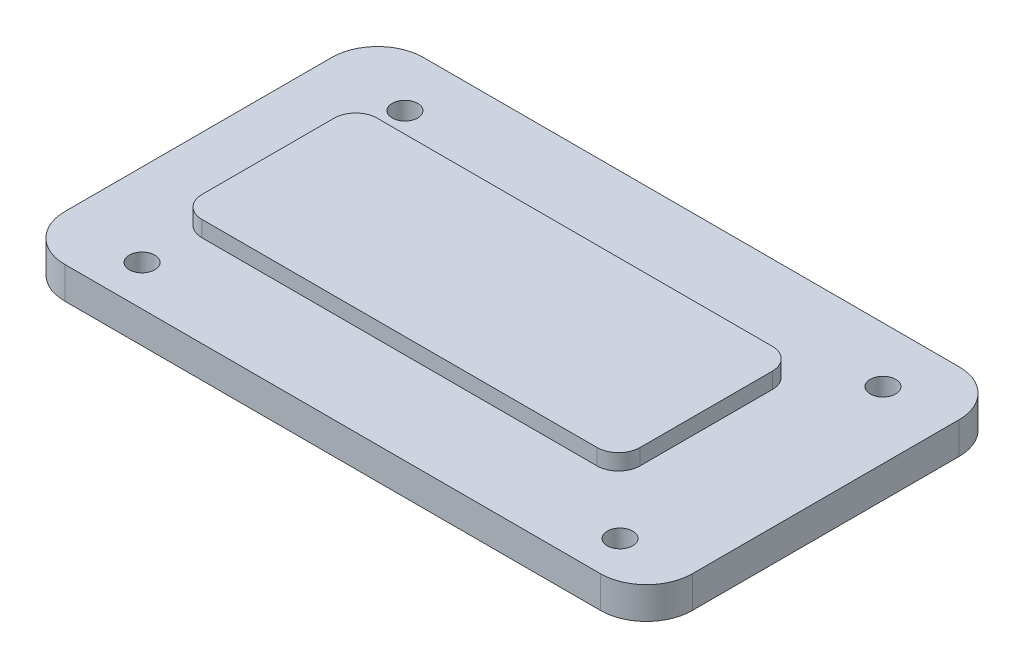
ISO-10303-21;
HEADER;
FILE_DESCRIPTION(('STEP AP214'),'2;1');
FILE_NAME('part.step','',(''),(''),'','','');
FILE_SCHEMA(('AUTOMOTIVE_DESIGN { 1 0 10303 214 1 1 1 1 }'));
ENDSEC;
DATA;
#1=APPLICATION_CONTEXT('core data for automotive mechanical design processes');
#2=APPLICATION_PROTOCOL_DEFINITION('international standard','automotive_design',2000,#1);
#3=PRODUCT_CONTEXT('',#1,'mechanical');
#4=PRODUCT('Part','Part','',(#3));
#5=PRODUCT_RELATED_PRODUCT_CATEGORY('part','',(#4));
#6=PRODUCT_DEFINITION_FORMATION('','',#4);
#7=PRODUCT_DEFINITION_CONTEXT('part definition',#1,'design');
#8=PRODUCT_DEFINITION('design','',#6,#7);
#9=PRODUCT_DEFINITION_SHAPE('','',#8);
#10=(LENGTH_UNIT() NAMED_UNIT(*) SI_UNIT(.MILLI.,.METRE.));
#11=(NAMED_UNIT(*) PLANE_ANGLE_UNIT() SI_UNIT($,.RADIAN.));
#12=(NAMED_UNIT(*) SI_UNIT($,.STERADIAN.) SOLID_ANGLE_UNIT());
#13=UNCERTAINTY_MEASURE_WITH_UNIT(LENGTH_MEASURE(1.E-05),#10,'distance_accuracy_value','');
#14=(GEOMETRIC_REPRESENTATION_CONTEXT(3) GLOBAL_UNCERTAINTY_ASSIGNED_CONTEXT((#13)) GLOBAL_UNIT_ASSIGNED_CONTEXT((#10,
#11,#12)) REPRESENTATION_CONTEXT('',''));
#15=CARTESIAN_POINT('',(0.,0.,0.));
#16=DIRECTION('',(0.,0.,1.));
#17=DIRECTION('',(1.,0.,0.));
#18=AXIS2_PLACEMENT_3D('',#15,#16,#17);
#19=CARTESIAN_POINT('',(18.375,3.,8.375));
#20=DIRECTION('',(0.,-1.,0.));
#21=DIRECTION('',(0.,0.,-1.));
#22=AXIS2_PLACEMENT_3D('',#19,#20,#21);
#23=CYLINDRICAL_SURFACE('',#22,2.875);
#24=CARTESIAN_POINT('',(18.375,2.,8.375));
#25=DIRECTION('',(0.,1.,0.));
#26=DIRECTION('',(0.,0.,1.));
#27=AXIS2_PLACEMENT_3D('',#24,#25,#26);
#28=CIRCLE('',#27,2.875);
#29=CARTESIAN_POINT('',(18.375,2.,11.25));
#30=VERTEX_POINT('',#29);
#31=CARTESIAN_POINT('',(21.25,2.,8.375));
#32=VERTEX_POINT('',#31);
#33=EDGE_CURVE('E216',#30,#32,#28,.T.);
#34=ORIENTED_EDGE('',*,*,#33,.F.);
#35=DIRECTION('',(0.,-1.,0.));
#36=VECTOR('',#35,1.);
#37=CARTESIAN_POINT('',(18.375,3.,11.25));
#38=LINE('',#37,#36);
#39=CARTESIAN_POINT('',(18.375,0.,11.25));
#40=VERTEX_POINT('',#39);
#41=EDGE_CURVE('E285',#30,#40,#38,.T.);
#42=ORIENTED_EDGE('',*,*,#41,.T.);
#43=CARTESIAN_POINT('',(18.375,0.,8.375));
#44=DIRECTION('',(0.,1.,0.));
#45=DIRECTION('',(0.,0.,1.));
#46=AXIS2_PLACEMENT_3D('',#43,#44,#45);
#47=CIRCLE('',#46,2.875);
#48=CARTESIAN_POINT('',(21.25,0.,8.375));
#49=VERTEX_POINT('',#48);
#50=EDGE_CURVE('E249',#40,#49,#47,.T.);
#51=ORIENTED_EDGE('',*,*,#50,.T.);
#52=DIRECTION('',(0.,-1.,0.));
#53=VECTOR('',#52,1.);
#54=CARTESIAN_POINT('',(21.25,3.,8.375));
#55=LINE('',#54,#53);
#56=EDGE_CURVE('E13',#32,#49,#55,.T.);
#57=ORIENTED_EDGE('',*,*,#56,.F.);
#58=EDGE_LOOP('',(#34,#42,#51,#57));
#59=FACE_BOUND('',#58,.T.);
#60=ADVANCED_FACE('F60',(#59),#23,.T.);
#61=CARTESIAN_POINT('',(21.25,3.,8.375));
#62=DIRECTION('',(-1.,0.,0.));
#63=DIRECTION('',(0.,0.,1.));
#64=AXIS2_PLACEMENT_3D('',#61,#62,#63);
#65=PLANE('',#64);
#66=DIRECTION('',(0.,0.,-1.));
#67=VECTOR('',#66,1.);
#68=CARTESIAN_POINT('',(21.25,2.,0.));
#69=LINE('',#68,#67);
#70=CARTESIAN_POINT('',(21.25,2.,-8.375));
#71=VERTEX_POINT('',#70);
#72=EDGE_CURVE('E218',#32,#71,#69,.T.);
#73=ORIENTED_EDGE('',*,*,#72,.F.);
#74=ORIENTED_EDGE('',*,*,#56,.T.);
#75=DIRECTION('',(0.,0.,-1.));
#76=VECTOR('',#75,1.);
#77=CARTESIAN_POINT('',(21.25,0.,8.375));
#78=LINE('',#77,#76);
#79=CARTESIAN_POINT('',(21.25,0.,-8.375));
#80=VERTEX_POINT('',#79);
#81=EDGE_CURVE('E263',#49,#80,#78,.T.);
#82=ORIENTED_EDGE('',*,*,#81,.T.);
#83=DIRECTION('',(0.,-1.,0.));
#84=VECTOR('',#83,1.);
#85=CARTESIAN_POINT('',(21.25,3.,-8.375));
#86=LINE('',#85,#84);
#87=EDGE_CURVE('E68',#71,#80,#86,.T.);
#88=ORIENTED_EDGE('',*,*,#87,.F.);
#89=EDGE_LOOP('',(#73,#74,#82,#88));
#90=FACE_BOUND('',#89,.T.);
#91=ADVANCED_FACE('F384',(#90),#65,.F.);
#92=CARTESIAN_POINT('',(18.375,3.,-8.375));
#93=DIRECTION('',(0.,-1.,0.));
#94=DIRECTION('',(0.,0.,-1.));
#95=AXIS2_PLACEMENT_3D('',#92,#93,#94);
#96=CYLINDRICAL_SURFACE('',#95,2.875);
#97=CARTESIAN_POINT('',(18.375,2.,-8.375));
#98=DIRECTION('',(0.,1.,0.));
#99=DIRECTION('',(0.,0.,1.));
#100=AXIS2_PLACEMENT_3D('',#97,#98,#99);
#101=CIRCLE('',#100,2.875);
#102=CARTESIAN_POINT('',(18.375,2.,-11.25));
#103=VERTEX_POINT('',#102);
#104=EDGE_CURVE('E220',#71,#103,#101,.T.);
#105=ORIENTED_EDGE('',*,*,#104,.F.);
#106=ORIENTED_EDGE('',*,*,#87,.T.);
#107=CARTESIAN_POINT('',(18.375,0.,-8.375));
#108=DIRECTION('',(0.,1.,0.));
#109=DIRECTION('',(0.,0.,1.));
#110=AXIS2_PLACEMENT_3D('',#107,#108,#109);
#111=CIRCLE('',#110,2.875);
#112=CARTESIAN_POINT('',(18.375,0.,-11.25));
#113=VERTEX_POINT('',#112);
#114=EDGE_CURVE('E266',#80,#113,#111,.T.);
#115=ORIENTED_EDGE('',*,*,#114,.T.);
#116=DIRECTION('',(0.,-1.,0.));
#117=VECTOR('',#116,1.);
#118=CARTESIAN_POINT('',(18.375,3.,-11.25));
#119=LINE('',#118,#117);
#120=EDGE_CURVE('E295',#103,#113,#119,.T.);
#121=ORIENTED_EDGE('',*,*,#120,.F.);
#122=EDGE_LOOP('',(#105,#106,#115,#121));
#123=FACE_BOUND('',#122,.T.);
#124=ADVANCED_FACE('F380',(#123),#96,.T.);
#125=CARTESIAN_POINT('',(18.375,3.,-11.25));
#126=DIRECTION('',(0.,0.,1.));
#127=DIRECTION('',(1.,0.,0.));
#128=AXIS2_PLACEMENT_3D('',#125,#126,#127);
#129=PLANE('',#128);
#130=DIRECTION('',(-1.,0.,0.));
#131=VECTOR('',#130,1.);
#132=CARTESIAN_POINT('',(0.,2.,-11.25));
#133=LINE('',#132,#131);
#134=CARTESIAN_POINT('',(-15.25,2.,-11.25));
#135=VERTEX_POINT('',#134);
#136=EDGE_CURVE('E222',#103,#135,#133,.T.);
#137=ORIENTED_EDGE('',*,*,#136,.F.);
#138=ORIENTED_EDGE('',*,*,#120,.T.);
#139=DIRECTION('',(-1.,0.,0.));
#140=VECTOR('',#139,1.);
#141=CARTESIAN_POINT('',(18.375,0.,-11.25));
#142=LINE('',#141,#140);
#143=CARTESIAN_POINT('',(-15.25,0.,-11.25));
#144=VERTEX_POINT('',#143);
#145=EDGE_CURVE('E269',#113,#144,#142,.T.);
#146=ORIENTED_EDGE('',*,*,#145,.T.);
#147=DIRECTION('',(0.,-1.,0.));
#148=VECTOR('',#147,1.);
#149=CARTESIAN_POINT('',(-15.25,3.,-11.25));
#150=LINE('',#149,#148);
#151=EDGE_CURVE('E293',#135,#144,#150,.T.);
#152=ORIENTED_EDGE('',*,*,#151,.F.);
#153=EDGE_LOOP('',(#137,#138,#146,#152));
#154=FACE_BOUND('',#153,.T.);
#155=ADVANCED_FACE('F376',(#154),#129,.F.);
#156=CARTESIAN_POINT('',(-15.25,3.,-8.375));
#157=DIRECTION('',(0.,-1.,0.));
#158=DIRECTION('',(0.,0.,-1.));
#159=AXIS2_PLACEMENT_3D('',#156,#157,#158);
#160=CYLINDRICAL_SURFACE('',#159,2.875);
#161=CARTESIAN_POINT('',(-15.25,2.,-8.375));
#162=DIRECTION('',(0.,1.,0.));
#163=DIRECTION('',(0.,0.,1.));
#164=AXIS2_PLACEMENT_3D('',#161,#162,#163);
#165=CIRCLE('',#164,2.875);
#166=CARTESIAN_POINT('',(-18.125,2.,-8.375));
#167=VERTEX_POINT('',#166);
#168=EDGE_CURVE('E224',#135,#167,#165,.T.);
#169=ORIENTED_EDGE('',*,*,#168,.F.);
#170=ORIENTED_EDGE('',*,*,#151,.T.);
#171=CARTESIAN_POINT('',(-15.25,0.,-8.375));
#172=DIRECTION('',(0.,1.,0.));
#173=DIRECTION('',(0.,0.,1.));
#174=AXIS2_PLACEMENT_3D('',#171,#172,#173);
#175=CIRCLE('',#174,2.875);
#176=CARTESIAN_POINT('',(-18.125,0.,-8.375));
#177=VERTEX_POINT('',#176);
#178=EDGE_CURVE('E272',#144,#177,#175,.T.);
#179=ORIENTED_EDGE('',*,*,#178,.T.);
#180=DIRECTION('',(0.,-1.,0.));
#181=VECTOR('',#180,1.);
#182=CARTESIAN_POINT('',(-18.125,3.,-8.375));
#183=LINE('',#182,#181);
#184=EDGE_CURVE('E291',#167,#177,#183,.T.);
#185=ORIENTED_EDGE('',*,*,#184,.F.);
#186=EDGE_LOOP('',(#169,#170,#179,#185));
#187=FACE_BOUND('',#186,.T.);
#188=ADVANCED_FACE('F372',(#187),#160,.T.);
#189=CARTESIAN_POINT('',(-18.125,3.,-8.375));
#190=DIRECTION('',(1.,0.,0.));
#191=DIRECTION('',(0.,0.,-1.));
#192=AXIS2_PLACEMENT_3D('',#189,#190,#191);
#193=PLANE('',#192);
#194=DIRECTION('',(0.,0.,1.));
#195=VECTOR('',#194,1.);
#196=CARTESIAN_POINT('',(-18.125,2.,0.));
#197=LINE('',#196,#195);
#198=CARTESIAN_POINT('',(-18.125,2.,8.375));
#199=VERTEX_POINT('',#198);
#200=EDGE_CURVE('E226',#167,#199,#197,.T.);
#201=ORIENTED_EDGE('',*,*,#200,.F.);
#202=ORIENTED_EDGE('',*,*,#184,.T.);
#203=DIRECTION('',(0.,0.,1.));
#204=VECTOR('',#203,1.);
#205=CARTESIAN_POINT('',(-18.125,0.,-8.375));
#206=LINE('',#205,#204);
#207=CARTESIAN_POINT('',(-18.125,0.,8.375));
#208=VERTEX_POINT('',#207);
#209=EDGE_CURVE('E275',#177,#208,#206,.T.);
#210=ORIENTED_EDGE('',*,*,#209,.T.);
#211=DIRECTION('',(0.,-1.,0.));
#212=VECTOR('',#211,1.);
#213=CARTESIAN_POINT('',(-18.125,3.,8.375));
#214=LINE('',#213,#212);
#215=EDGE_CURVE('E289',#199,#208,#214,.T.);
#216=ORIENTED_EDGE('',*,*,#215,.F.);
#217=EDGE_LOOP('',(#201,#202,#210,#216));
#218=FACE_BOUND('',#217,.T.);
#219=ADVANCED_FACE('F368',(#218),#193,.F.);
#220=CARTESIAN_POINT('',(-15.25,3.,8.375));
#221=DIRECTION('',(0.,-1.,0.));
#222=DIRECTION('',(0.,0.,-1.));
#223=AXIS2_PLACEMENT_3D('',#220,#221,#222);
#224=CYLINDRICAL_SURFACE('',#223,2.875);
#225=CARTESIAN_POINT('',(-15.25,2.,8.375));
#226=DIRECTION('',(0.,1.,0.));
#227=DIRECTION('',(0.,0.,1.));
#228=AXIS2_PLACEMENT_3D('',#225,#226,#227);
#229=CIRCLE('',#228,2.875);
#230=CARTESIAN_POINT('',(-15.25,2.,11.25));
#231=VERTEX_POINT('',#230);
#232=EDGE_CURVE('E76',#199,#231,#229,.T.);
#233=ORIENTED_EDGE('',*,*,#232,.F.);
#234=ORIENTED_EDGE('',*,*,#215,.T.);
#235=CARTESIAN_POINT('',(-15.25,0.,8.375));
#236=DIRECTION('',(0.,1.,0.));
#237=DIRECTION('',(0.,0.,1.));
#238=AXIS2_PLACEMENT_3D('',#235,#236,#237);
#239=CIRCLE('',#238,2.875);
#240=CARTESIAN_POINT('',(-15.25,0.,11.25));
#241=VERTEX_POINT('',#240);
#242=EDGE_CURVE('E278',#208,#241,#239,.T.);
#243=ORIENTED_EDGE('',*,*,#242,.T.);
#244=DIRECTION('',(0.,-1.,0.));
#245=VECTOR('',#244,1.);
#246=CARTESIAN_POINT('',(-15.25,3.,11.25));
#247=LINE('',#246,#245);
#248=EDGE_CURVE('E287',#231,#241,#247,.T.);
#249=ORIENTED_EDGE('',*,*,#248,.F.);
#250=EDGE_LOOP('',(#233,#234,#243,#249));
#251=FACE_BOUND('',#250,.T.);
#252=ADVANCED_FACE('F361',(#251),#224,.T.);
#253=CARTESIAN_POINT('',(-15.25,3.,11.25));
#254=DIRECTION('',(0.,0.,-1.));
#255=DIRECTION('',(-1.,0.,0.));
#256=AXIS2_PLACEMENT_3D('',#253,#254,#255);
#257=PLANE('',#256);
#258=DIRECTION('',(1.,0.,0.));
#259=VECTOR('',#258,1.);
#260=CARTESIAN_POINT('',(0.,2.,11.25));
#261=LINE('',#260,#259);
#262=EDGE_CURVE('E214',#231,#30,#261,.T.);
#263=ORIENTED_EDGE('',*,*,#262,.F.);
#264=ORIENTED_EDGE('',*,*,#248,.T.);
#265=DIRECTION('',(1.,0.,0.));
#266=VECTOR('',#265,1.);
#267=CARTESIAN_POINT('',(-15.25,0.,11.25));
#268=LINE('',#267,#266);
#269=EDGE_CURVE('E281',#241,#40,#268,.T.);
#270=ORIENTED_EDGE('',*,*,#269,.T.);
#271=ORIENTED_EDGE('',*,*,#41,.F.);
#272=EDGE_LOOP('',(#263,#264,#270,#271));
#273=FACE_BOUND('',#272,.T.);
#274=ADVANCED_FACE('F345',(#273),#257,.F.);
#275=CARTESIAN_POINT('',(18.375,0.,8.375));
#276=DIRECTION('',(0.,1.,0.));
#277=DIRECTION('',(0.,0.,1.));
#278=AXIS2_PLACEMENT_3D('',#275,#276,#277);
#279=PLANE('',#278);
#280=CARTESIAN_POINT('',(-12.9352841588239,0.,8.72096796229094));
#281=DIRECTION('',(0.,-1.,0.));
#282=DIRECTION('',(0.,0.,-1.));
#283=AXIS2_PLACEMENT_3D('',#280,#281,#282);
#284=CIRCLE('',#283,0.800000000000001);
#285=CARTESIAN_POINT('',(-12.9352841588239,0.,7.92096796229094));
#286=VERTEX_POINT('',#285);
#287=EDGE_CURVE('E331',#286,#286,#284,.T.);
#288=ORIENTED_EDGE('',*,*,#287,.F.);
#289=EDGE_LOOP('',(#288));
#290=FACE_BOUND('',#289,.T.);
#291=CARTESIAN_POINT('',(17.0647158411761,0.,-7.77903203770906));
#292=DIRECTION('',(0.,-1.,0.));
#293=DIRECTION('',(0.,0.,-1.));
#294=AXIS2_PLACEMENT_3D('',#291,#292,#293);
#295=CIRCLE('',#294,0.799999999999999);
#296=CARTESIAN_POINT('',(17.0647158411761,0.,-8.57903203770906));
#297=VERTEX_POINT('',#296);
#298=EDGE_CURVE('E333',#297,#297,#295,.T.);
#299=ORIENTED_EDGE('',*,*,#298,.F.);
#300=EDGE_LOOP('',(#299));
#301=FACE_BOUND('',#300,.T.);
#302=CARTESIAN_POINT('',(17.0647158411761,0.,8.72096796229094));
#303=DIRECTION('',(0.,-1.,0.));
#304=DIRECTION('',(0.,0.,-1.));
#305=AXIS2_PLACEMENT_3D('',#302,#303,#304);
#306=CIRCLE('',#305,0.799999999999999);
#307=CARTESIAN_POINT('',(17.0647158411761,0.,7.92096796229094));
#308=VERTEX_POINT('',#307);
#309=EDGE_CURVE('E337',#308,#308,#306,.T.);
#310=ORIENTED_EDGE('',*,*,#309,.F.);
#311=EDGE_LOOP('',(#310));
#312=FACE_BOUND('',#311,.T.);
#313=CARTESIAN_POINT('',(-12.9352841588239,0.,-7.77903203770906));
#314=DIRECTION('',(0.,-1.,0.));
#315=DIRECTION('',(0.,0.,-1.));
#316=AXIS2_PLACEMENT_3D('',#313,#314,#315);
#317=CIRCLE('',#316,0.800000000000001);
#318=CARTESIAN_POINT('',(-12.9352841588239,0.,-8.57903203770906));
#319=VERTEX_POINT('',#318);
#320=EDGE_CURVE('E200',#319,#319,#317,.T.);
#321=ORIENTED_EDGE('',*,*,#320,.F.);
#322=EDGE_LOOP('',(#321));
#323=FACE_BOUND('',#322,.T.);
#324=ORIENTED_EDGE('',*,*,#50,.F.);
#325=ORIENTED_EDGE('',*,*,#269,.F.);
#326=ORIENTED_EDGE('',*,*,#242,.F.);
#327=ORIENTED_EDGE('',*,*,#209,.F.);
#328=ORIENTED_EDGE('',*,*,#178,.F.);
#329=ORIENTED_EDGE('',*,*,#145,.F.);
#330=ORIENTED_EDGE('',*,*,#114,.F.);
#331=ORIENTED_EDGE('',*,*,#81,.F.);
#332=EDGE_LOOP('',(#324,#325,#326,#327,#328,#329,#330,#331));
#333=FACE_BOUND('',#332,.T.);
#334=ADVANCED_FACE('F343',(#290,#301,#312,#323,#333),#279,.F.);
#335=CARTESIAN_POINT('',(-12.4,2.,-4.15));
#336=DIRECTION('',(0.,1.,0.));
#337=DIRECTION('',(0.,0.,1.));
#338=AXIS2_PLACEMENT_3D('',#335,#336,#337);
#339=CYLINDRICAL_SURFACE('',#338,1.35);
#340=CARTESIAN_POINT('',(-12.4,3.,-4.15));
#341=DIRECTION('',(0.,1.,0.));
#342=DIRECTION('',(0.,0.,1.));
#343=AXIS2_PLACEMENT_3D('',#340,#341,#342);
#344=CIRCLE('',#343,1.35);
#345=CARTESIAN_POINT('',(-12.4,3.,-5.5));
#346=VERTEX_POINT('',#345);
#347=CARTESIAN_POINT('',(-13.75,3.,-4.15));
#348=VERTEX_POINT('',#347);
#349=EDGE_CURVE('E84',#346,#348,#344,.T.);
#350=ORIENTED_EDGE('',*,*,#349,.F.);
#351=DIRECTION('',(0.,1.,0.));
#352=VECTOR('',#351,1.);
#353=CARTESIAN_POINT('',(-12.4,2.,-5.5));
#354=LINE('',#353,#352);
#355=CARTESIAN_POINT('',(-12.4,2.,-5.5));
#356=VERTEX_POINT('',#355);
#357=EDGE_CURVE('E178',#356,#346,#354,.T.);
#358=ORIENTED_EDGE('',*,*,#357,.F.);
#359=CARTESIAN_POINT('',(-12.4,2.,-4.15));
#360=DIRECTION('',(0.,1.,0.));
#361=DIRECTION('',(0.,0.,1.));
#362=AXIS2_PLACEMENT_3D('',#359,#360,#361);
#363=CIRCLE('',#362,1.35);
#364=CARTESIAN_POINT('',(-13.75,2.,-4.15));
#365=VERTEX_POINT('',#364);
#366=EDGE_CURVE('E185',#356,#365,#363,.T.);
#367=ORIENTED_EDGE('',*,*,#366,.T.);
#368=DIRECTION('',(0.,1.,0.));
#369=VECTOR('',#368,1.);
#370=CARTESIAN_POINT('',(-13.75,2.,-4.15));
#371=LINE('',#370,#369);
#372=EDGE_CURVE('E247',#365,#348,#371,.T.);
#373=ORIENTED_EDGE('',*,*,#372,.T.);
#374=EDGE_LOOP('',(#350,#358,#367,#373));
#375=FACE_BOUND('',#374,.T.);
#376=ADVANCED_FACE('F188',(#375),#339,.T.);
#377=CARTESIAN_POINT('',(-13.75,2.,0.));
#378=DIRECTION('',(-1.,0.,0.));
#379=DIRECTION('',(0.,0.,1.));
#380=AXIS2_PLACEMENT_3D('',#377,#378,#379);
#381=PLANE('',#380);
#382=DIRECTION('',(0.,0.,1.));
#383=VECTOR('',#382,1.);
#384=CARTESIAN_POINT('',(-13.75,3.,0.));
#385=LINE('',#384,#383);
#386=CARTESIAN_POINT('',(-13.75,3.,4.15));
#387=VERTEX_POINT('',#386);
#388=EDGE_CURVE('E194',#348,#387,#385,.T.);
#389=ORIENTED_EDGE('',*,*,#388,.F.);
#390=ORIENTED_EDGE('',*,*,#372,.F.);
#391=DIRECTION('',(0.,0.,1.));
#392=VECTOR('',#391,1.);
#393=CARTESIAN_POINT('',(-13.75,2.,0.));
#394=LINE('',#393,#392);
#395=CARTESIAN_POINT('',(-13.75,2.,4.15));
#396=VERTEX_POINT('',#395);
#397=EDGE_CURVE('E193',#365,#396,#394,.T.);
#398=ORIENTED_EDGE('',*,*,#397,.T.);
#399=DIRECTION('',(0.,1.,0.));
#400=VECTOR('',#399,1.);
#401=CARTESIAN_POINT('',(-13.75,2.,4.15));
#402=LINE('',#401,#400);
#403=EDGE_CURVE('E250',#396,#387,#402,.T.);
#404=ORIENTED_EDGE('',*,*,#403,.T.);
#405=EDGE_LOOP('',(#389,#390,#398,#404));
#406=FACE_BOUND('',#405,.T.);
#407=ADVANCED_FACE('F407',(#406),#381,.T.);
#408=CARTESIAN_POINT('',(-12.4,2.,4.15));
#409=DIRECTION('',(0.,1.,0.));
#410=DIRECTION('',(0.,0.,1.));
#411=AXIS2_PLACEMENT_3D('',#408,#409,#410);
#412=CYLINDRICAL_SURFACE('',#411,1.35);
#413=CARTESIAN_POINT('',(-12.4,3.,4.15));
#414=DIRECTION('',(0.,1.,0.));
#415=DIRECTION('',(0.,0.,1.));
#416=AXIS2_PLACEMENT_3D('',#413,#414,#415);
#417=CIRCLE('',#416,1.35);
#418=CARTESIAN_POINT('',(-12.4,3.,5.5));
#419=VERTEX_POINT('',#418);
#420=EDGE_CURVE('E197',#387,#419,#417,.T.);
#421=ORIENTED_EDGE('',*,*,#420,.F.);
#422=ORIENTED_EDGE('',*,*,#403,.F.);
#423=CARTESIAN_POINT('',(-12.4,2.,4.15));
#424=DIRECTION('',(0.,1.,0.));
#425=DIRECTION('',(0.,0.,1.));
#426=AXIS2_PLACEMENT_3D('',#423,#424,#425);
#427=CIRCLE('',#426,1.35);
#428=CARTESIAN_POINT('',(-12.4,2.,5.5));
#429=VERTEX_POINT('',#428);
#430=EDGE_CURVE('E210',#396,#429,#427,.T.);
#431=ORIENTED_EDGE('',*,*,#430,.T.);
#432=DIRECTION('',(0.,1.,0.));
#433=VECTOR('',#432,1.);
#434=CARTESIAN_POINT('',(-12.4,2.,5.5));
#435=LINE('',#434,#433);
#436=EDGE_CURVE('E252',#429,#419,#435,.T.);
#437=ORIENTED_EDGE('',*,*,#436,.T.);
#438=EDGE_LOOP('',(#421,#422,#431,#437));
#439=FACE_BOUND('',#438,.T.);
#440=ADVANCED_FACE('F425',(#439),#412,.T.);
#441=CARTESIAN_POINT('',(0.,2.,5.5));
#442=DIRECTION('',(0.,0.,1.));
#443=DIRECTION('',(1.,0.,0.));
#444=AXIS2_PLACEMENT_3D('',#441,#442,#443);
#445=PLANE('',#444);
#446=DIRECTION('',(1.,0.,0.));
#447=VECTOR('',#446,1.);
#448=CARTESIAN_POINT('',(0.,3.,5.5));
#449=LINE('',#448,#447);
#450=CARTESIAN_POINT('',(12.4,3.,5.5));
#451=VERTEX_POINT('',#450);
#452=EDGE_CURVE('E242',#419,#451,#449,.T.);
#453=ORIENTED_EDGE('',*,*,#452,.F.);
#454=ORIENTED_EDGE('',*,*,#436,.F.);
#455=DIRECTION('',(1.,0.,0.));
#456=VECTOR('',#455,1.);
#457=CARTESIAN_POINT('',(0.,2.,5.5));
#458=LINE('',#457,#456);
#459=CARTESIAN_POINT('',(12.4,2.,5.5));
#460=VERTEX_POINT('',#459);
#461=EDGE_CURVE('E208',#429,#460,#458,.T.);
#462=ORIENTED_EDGE('',*,*,#461,.T.);
#463=DIRECTION('',(0.,1.,0.));
#464=VECTOR('',#463,1.);
#465=CARTESIAN_POINT('',(12.4,2.,5.5));
#466=LINE('',#465,#464);
#467=EDGE_CURVE('E254',#460,#451,#466,.T.);
#468=ORIENTED_EDGE('',*,*,#467,.T.);
#469=EDGE_LOOP('',(#453,#454,#462,#468));
#470=FACE_BOUND('',#469,.T.);
#471=ADVANCED_FACE('F421',(#470),#445,.T.);
#472=CARTESIAN_POINT('',(12.4,2.,4.15));
#473=DIRECTION('',(0.,1.,0.));
#474=DIRECTION('',(0.,0.,1.));
#475=AXIS2_PLACEMENT_3D('',#472,#473,#474);
#476=CYLINDRICAL_SURFACE('',#475,1.35);
#477=CARTESIAN_POINT('',(12.4,3.,4.15));
#478=DIRECTION('',(0.,1.,0.));
#479=DIRECTION('',(0.,0.,1.));
#480=AXIS2_PLACEMENT_3D('',#477,#478,#479);
#481=CIRCLE('',#480,1.35);
#482=CARTESIAN_POINT('',(13.75,3.,4.15));
#483=VERTEX_POINT('',#482);
#484=EDGE_CURVE('E239',#451,#483,#481,.T.);
#485=ORIENTED_EDGE('',*,*,#484,.F.);
#486=ORIENTED_EDGE('',*,*,#467,.F.);
#487=CARTESIAN_POINT('',(12.4,2.,4.15));
#488=DIRECTION('',(0.,1.,0.));
#489=DIRECTION('',(0.,0.,1.));
#490=AXIS2_PLACEMENT_3D('',#487,#488,#489);
#491=CIRCLE('',#490,1.35);
#492=CARTESIAN_POINT('',(13.75,2.,4.15));
#493=VERTEX_POINT('',#492);
#494=EDGE_CURVE('E206',#460,#493,#491,.T.);
#495=ORIENTED_EDGE('',*,*,#494,.T.);
#496=DIRECTION('',(0.,1.,0.));
#497=VECTOR('',#496,1.);
#498=CARTESIAN_POINT('',(13.75,2.,4.15));
#499=LINE('',#498,#497);
#500=EDGE_CURVE('E256',#493,#483,#499,.T.);
#501=ORIENTED_EDGE('',*,*,#500,.T.);
#502=EDGE_LOOP('',(#485,#486,#495,#501));
#503=FACE_BOUND('',#502,.T.);
#504=ADVANCED_FACE('F417',(#503),#476,.T.);
#505=CARTESIAN_POINT('',(13.75,2.,0.));
#506=DIRECTION('',(1.,0.,0.));
#507=DIRECTION('',(0.,0.,-1.));
#508=AXIS2_PLACEMENT_3D('',#505,#506,#507);
#509=PLANE('',#508);
#510=DIRECTION('',(0.,0.,-1.));
#511=VECTOR('',#510,1.);
#512=CARTESIAN_POINT('',(13.75,3.,0.));
#513=LINE('',#512,#511);
#514=CARTESIAN_POINT('',(13.75,3.,-4.15));
#515=VERTEX_POINT('',#514);
#516=EDGE_CURVE('E236',#483,#515,#513,.T.);
#517=ORIENTED_EDGE('',*,*,#516,.F.);
#518=ORIENTED_EDGE('',*,*,#500,.F.);
#519=DIRECTION('',(0.,0.,-1.));
#520=VECTOR('',#519,1.);
#521=CARTESIAN_POINT('',(13.75,2.,0.));
#522=LINE('',#521,#520);
#523=CARTESIAN_POINT('',(13.75,2.,-4.15));
#524=VERTEX_POINT('',#523);
#525=EDGE_CURVE('E204',#493,#524,#522,.T.);
#526=ORIENTED_EDGE('',*,*,#525,.T.);
#527=DIRECTION('',(0.,1.,0.));
#528=VECTOR('',#527,1.);
#529=CARTESIAN_POINT('',(13.75,2.,-4.15));
#530=LINE('',#529,#528);
#531=EDGE_CURVE('E258',#524,#515,#530,.T.);
#532=ORIENTED_EDGE('',*,*,#531,.T.);
#533=EDGE_LOOP('',(#517,#518,#526,#532));
#534=FACE_BOUND('',#533,.T.);
#535=ADVANCED_FACE('F413',(#534),#509,.T.);
#536=CARTESIAN_POINT('',(12.4,2.,-4.15));
#537=DIRECTION('',(0.,1.,0.));
#538=DIRECTION('',(0.,0.,1.));
#539=AXIS2_PLACEMENT_3D('',#536,#537,#538);
#540=CYLINDRICAL_SURFACE('',#539,1.35);
#541=CARTESIAN_POINT('',(12.4,3.,-4.15));
#542=DIRECTION('',(0.,1.,0.));
#543=DIRECTION('',(0.,0.,1.));
#544=AXIS2_PLACEMENT_3D('',#541,#542,#543);
#545=CIRCLE('',#544,1.35);
#546=CARTESIAN_POINT('',(12.4,3.,-5.5));
#547=VERTEX_POINT('',#546);
#548=EDGE_CURVE('E233',#515,#547,#545,.T.);
#549=ORIENTED_EDGE('',*,*,#548,.F.);
#550=ORIENTED_EDGE('',*,*,#531,.F.);
#551=CARTESIAN_POINT('',(12.4,2.,-4.15));
#552=DIRECTION('',(0.,1.,0.));
#553=DIRECTION('',(0.,0.,1.));
#554=AXIS2_PLACEMENT_3D('',#551,#552,#553);
#555=CIRCLE('',#554,1.35);
#556=CARTESIAN_POINT('',(12.4,2.,-5.5));
#557=VERTEX_POINT('',#556);
#558=EDGE_CURVE('E184',#524,#557,#555,.T.);
#559=ORIENTED_EDGE('',*,*,#558,.T.);
#560=DIRECTION('',(0.,1.,0.));
#561=VECTOR('',#560,1.);
#562=CARTESIAN_POINT('',(12.4,2.,-5.5));
#563=LINE('',#562,#561);
#564=EDGE_CURVE('E180',#557,#547,#563,.T.);
#565=ORIENTED_EDGE('',*,*,#564,.T.);
#566=EDGE_LOOP('',(#549,#550,#559,#565));
#567=FACE_BOUND('',#566,.T.);
#568=ADVANCED_FACE('F410',(#567),#540,.T.);
#569=CARTESIAN_POINT('',(0.,2.,-5.5));
#570=DIRECTION('',(0.,0.,-1.));
#571=DIRECTION('',(-1.,0.,0.));
#572=AXIS2_PLACEMENT_3D('',#569,#570,#571);
#573=PLANE('',#572);
#574=DIRECTION('',(-1.,0.,0.));
#575=VECTOR('',#574,1.);
#576=CARTESIAN_POINT('',(0.,3.,-5.5));
#577=LINE('',#576,#575);
#578=EDGE_CURVE('E231',#547,#346,#577,.T.);
#579=ORIENTED_EDGE('',*,*,#578,.F.);
#580=ORIENTED_EDGE('',*,*,#564,.F.);
#581=DIRECTION('',(-1.,0.,0.));
#582=VECTOR('',#581,1.);
#583=CARTESIAN_POINT('',(0.,2.,-5.5));
#584=LINE('',#583,#582);
#585=EDGE_CURVE('E175',#557,#356,#584,.T.);
#586=ORIENTED_EDGE('',*,*,#585,.T.);
#587=ORIENTED_EDGE('',*,*,#357,.T.);
#588=EDGE_LOOP('',(#579,#580,#586,#587));
#589=FACE_BOUND('',#588,.T.);
#590=ADVANCED_FACE('F177',(#589),#573,.T.);
#591=CARTESIAN_POINT('',(0.,2.,0.));
#592=DIRECTION('',(0.,1.,0.));
#593=DIRECTION('',(0.,0.,1.));
#594=AXIS2_PLACEMENT_3D('',#591,#592,#593);
#595=PLANE('',#594);
#596=CARTESIAN_POINT('',(-12.9352841588239,2.,8.72096796229094));
#597=DIRECTION('',(0.,1.,0.));
#598=DIRECTION('',(0.,0.,1.));
#599=AXIS2_PLACEMENT_3D('',#596,#597,#598);
#600=CIRCLE('',#599,0.800000000000001);
#601=CARTESIAN_POINT('',(-12.9352841588239,2.,9.52096796229094));
#602=VERTEX_POINT('',#601);
#603=EDGE_CURVE('E63',#602,#602,#600,.T.);
#604=ORIENTED_EDGE('',*,*,#603,.F.);
#605=EDGE_LOOP('',(#604));
#606=FACE_BOUND('',#605,.T.);
#607=CARTESIAN_POINT('',(17.0647158411761,2.,-7.77903203770906));
#608=DIRECTION('',(0.,1.,0.));
#609=DIRECTION('',(0.,0.,1.));
#610=AXIS2_PLACEMENT_3D('',#607,#608,#609);
#611=CIRCLE('',#610,0.799999999999999);
#612=CARTESIAN_POINT('',(17.0647158411761,2.,-6.97903203770906));
#613=VERTEX_POINT('',#612);
#614=EDGE_CURVE('E304',#613,#613,#611,.T.);
#615=ORIENTED_EDGE('',*,*,#614,.F.);
#616=EDGE_LOOP('',(#615));
#617=FACE_BOUND('',#616,.T.);
#618=CARTESIAN_POINT('',(17.0647158411761,2.,8.72096796229094));
#619=DIRECTION('',(0.,1.,0.));
#620=DIRECTION('',(0.,0.,1.));
#621=AXIS2_PLACEMENT_3D('',#618,#619,#620);
#622=CIRCLE('',#621,0.799999999999999);
#623=CARTESIAN_POINT('',(17.0647158411761,2.,9.52096796229094));
#624=VERTEX_POINT('',#623);
#625=EDGE_CURVE('E300',#624,#624,#622,.T.);
#626=ORIENTED_EDGE('',*,*,#625,.F.);
#627=EDGE_LOOP('',(#626));
#628=FACE_BOUND('',#627,.T.);
#629=CARTESIAN_POINT('',(-12.9352841588239,2.,-7.77903203770906));
#630=DIRECTION('',(0.,1.,0.));
#631=DIRECTION('',(0.,0.,1.));
#632=AXIS2_PLACEMENT_3D('',#629,#630,#631);
#633=CIRCLE('',#632,0.800000000000001);
#634=CARTESIAN_POINT('',(-12.9352841588239,2.,-6.97903203770906));
#635=VERTEX_POINT('',#634);
#636=EDGE_CURVE('E298',#635,#635,#633,.T.);
#637=ORIENTED_EDGE('',*,*,#636,.F.);
#638=EDGE_LOOP('',(#637));
#639=FACE_BOUND('',#638,.T.);
#640=ORIENTED_EDGE('',*,*,#366,.F.);
#641=ORIENTED_EDGE('',*,*,#585,.F.);
#642=ORIENTED_EDGE('',*,*,#558,.F.);
#643=ORIENTED_EDGE('',*,*,#525,.F.);
#644=ORIENTED_EDGE('',*,*,#494,.F.);
#645=ORIENTED_EDGE('',*,*,#461,.F.);
#646=ORIENTED_EDGE('',*,*,#430,.F.);
#647=ORIENTED_EDGE('',*,*,#397,.F.);
#648=EDGE_LOOP('',(#640,#641,#642,#643,#644,#645,#646,#647));
#649=FACE_BOUND('',#648,.T.);
#650=ORIENTED_EDGE('',*,*,#262,.T.);
#651=ORIENTED_EDGE('',*,*,#33,.T.);
#652=ORIENTED_EDGE('',*,*,#72,.T.);
#653=ORIENTED_EDGE('',*,*,#104,.T.);
#654=ORIENTED_EDGE('',*,*,#136,.T.);
#655=ORIENTED_EDGE('',*,*,#168,.T.);
#656=ORIENTED_EDGE('',*,*,#200,.T.);
#657=ORIENTED_EDGE('',*,*,#232,.T.);
#658=EDGE_LOOP('',(#650,#651,#652,#653,#654,#655,#656,#657));
#659=FACE_BOUND('',#658,.T.);
#660=ADVANCED_FACE('F191',(#606,#617,#628,#639,#649,#659),#595,.T.);
#661=CARTESIAN_POINT('',(18.375,3.,8.375));
#662=DIRECTION('',(0.,1.,0.));
#663=DIRECTION('',(0.,0.,1.));
#664=AXIS2_PLACEMENT_3D('',#661,#662,#663);
#665=PLANE('',#664);
#666=ORIENTED_EDGE('',*,*,#578,.T.);
#667=ORIENTED_EDGE('',*,*,#349,.T.);
#668=ORIENTED_EDGE('',*,*,#388,.T.);
#669=ORIENTED_EDGE('',*,*,#420,.T.);
#670=ORIENTED_EDGE('',*,*,#452,.T.);
#671=ORIENTED_EDGE('',*,*,#484,.T.);
#672=ORIENTED_EDGE('',*,*,#516,.T.);
#673=ORIENTED_EDGE('',*,*,#548,.T.);
#674=EDGE_LOOP('',(#666,#667,#668,#669,#670,#671,#672,#673));
#675=FACE_BOUND('',#674,.T.);
#676=ADVANCED_FACE('F316',(#675),#665,.T.);
#677=CARTESIAN_POINT('',(-12.9352841588239,3.,-7.77903203770906));
#678=DIRECTION('',(0.,-1.,0.));
#679=DIRECTION('',(0.,0.,-1.));
#680=AXIS2_PLACEMENT_3D('',#677,#678,#679);
#681=CYLINDRICAL_SURFACE('',#680,0.800000000000001);
#682=ORIENTED_EDGE('',*,*,#636,.T.);
#683=EDGE_LOOP('',(#682));
#684=FACE_BOUND('',#683,.T.);
#685=ORIENTED_EDGE('',*,*,#320,.T.);
#686=EDGE_LOOP('',(#685));
#687=FACE_BOUND('',#686,.T.);
#688=ADVANCED_FACE('F323',(#684,#687),#681,.F.);
#689=CARTESIAN_POINT('',(17.0647158411761,3.,8.72096796229094));
#690=DIRECTION('',(0.,-1.,0.));
#691=DIRECTION('',(0.,0.,-1.));
#692=AXIS2_PLACEMENT_3D('',#689,#690,#691);
#693=CYLINDRICAL_SURFACE('',#692,0.799999999999999);
#694=ORIENTED_EDGE('',*,*,#625,.T.);
#695=EDGE_LOOP('',(#694));
#696=FACE_BOUND('',#695,.T.);
#697=ORIENTED_EDGE('',*,*,#309,.T.);
#698=EDGE_LOOP('',(#697));
#699=FACE_BOUND('',#698,.T.);
#700=ADVANCED_FACE('F326',(#696,#699),#693,.F.);
#701=CARTESIAN_POINT('',(17.0647158411761,3.,-7.77903203770906));
#702=DIRECTION('',(0.,-1.,0.));
#703=DIRECTION('',(0.,0.,-1.));
#704=AXIS2_PLACEMENT_3D('',#701,#702,#703);
#705=CYLINDRICAL_SURFACE('',#704,0.799999999999999);
#706=ORIENTED_EDGE('',*,*,#614,.T.);
#707=EDGE_LOOP('',(#706));
#708=FACE_BOUND('',#707,.T.);
#709=ORIENTED_EDGE('',*,*,#298,.T.);
#710=EDGE_LOOP('',(#709));
#711=FACE_BOUND('',#710,.T.);
#712=ADVANCED_FACE('F433',(#708,#711),#705,.F.);
#713=CARTESIAN_POINT('',(-12.9352841588239,3.,8.72096796229094));
#714=DIRECTION('',(0.,-1.,0.));
#715=DIRECTION('',(0.,0.,-1.));
#716=AXIS2_PLACEMENT_3D('',#713,#714,#715);
#717=CYLINDRICAL_SURFACE('',#716,0.800000000000001);
#718=ORIENTED_EDGE('',*,*,#603,.T.);
#719=EDGE_LOOP('',(#718));
#720=FACE_BOUND('',#719,.T.);
#721=ORIENTED_EDGE('',*,*,#287,.T.);
#722=EDGE_LOOP('',(#721));
#723=FACE_BOUND('',#722,.T.);
#724=ADVANCED_FACE('F311',(#720,#723),#717,.F.);
#725=CLOSED_SHELL('',(#60,#91,#124,#155,#188,#219,#252,#274,#334,#376,#407,#440,#471,#504,#535,
#568,#590,#660,#676,#688,#700,#712,#724));
#726=MANIFOLD_SOLID_BREP('B2',#725);
#727=ADVANCED_BREP_SHAPE_REPRESENTATION('',(#18,#726),#14);
#728=SHAPE_DEFINITION_REPRESENTATION(#9,#727);
ENDSEC;
END-ISO-10303-21;
